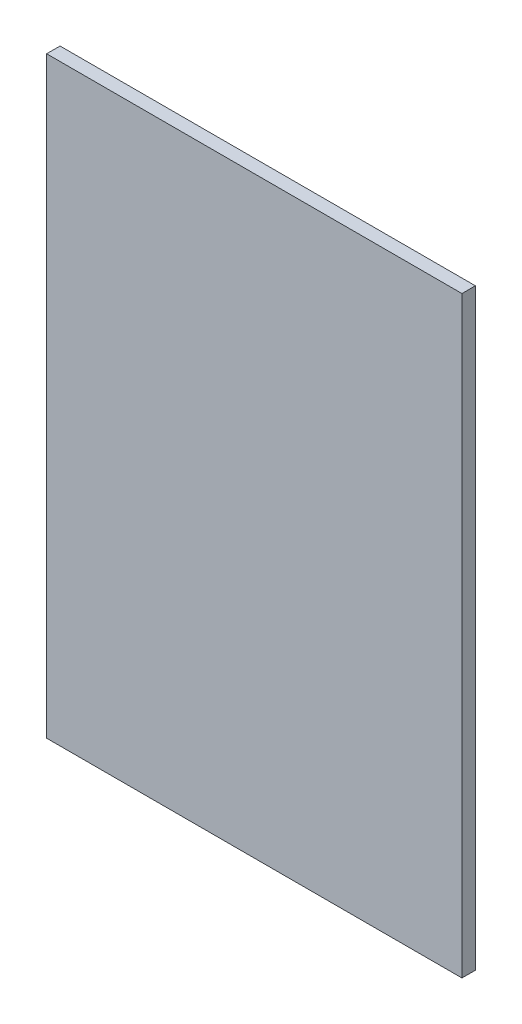
ISO-10303-21;
HEADER;
FILE_DESCRIPTION(('STEP AP214'),'2;1');
FILE_NAME('part.step','',(''),(''),'','','');
FILE_SCHEMA(('AUTOMOTIVE_DESIGN { 1 0 10303 214 1 1 1 1 }'));
ENDSEC;
DATA;
#1=APPLICATION_CONTEXT('core data for automotive mechanical design processes');
#2=APPLICATION_PROTOCOL_DEFINITION('international standard','automotive_design',2000,#1);
#3=PRODUCT_CONTEXT('',#1,'mechanical');
#4=PRODUCT('Part','Part','',(#3));
#5=PRODUCT_RELATED_PRODUCT_CATEGORY('part','',(#4));
#6=PRODUCT_DEFINITION_FORMATION('','',#4);
#7=PRODUCT_DEFINITION_CONTEXT('part definition',#1,'design');
#8=PRODUCT_DEFINITION('design','',#6,#7);
#9=PRODUCT_DEFINITION_SHAPE('','',#8);
#10=(LENGTH_UNIT() NAMED_UNIT(*) SI_UNIT(.MILLI.,.METRE.));
#11=(NAMED_UNIT(*) PLANE_ANGLE_UNIT() SI_UNIT($,.RADIAN.));
#12=(NAMED_UNIT(*) SI_UNIT($,.STERADIAN.) SOLID_ANGLE_UNIT());
#13=UNCERTAINTY_MEASURE_WITH_UNIT(LENGTH_MEASURE(1.E-05),#10,'distance_accuracy_value','');
#14=(GEOMETRIC_REPRESENTATION_CONTEXT(3) GLOBAL_UNCERTAINTY_ASSIGNED_CONTEXT((#13)) GLOBAL_UNIT_ASSIGNED_CONTEXT((#10,
#11,#12)) REPRESENTATION_CONTEXT('',''));
#15=CARTESIAN_POINT('',(0.,0.,0.));
#16=DIRECTION('',(0.,0.,1.));
#17=DIRECTION('',(1.,0.,0.));
#18=AXIS2_PLACEMENT_3D('',#15,#16,#17);
#19=CARTESIAN_POINT('',(96.5770034790039,93.4720001220703,0.));
#20=DIRECTION('',(1.,0.,0.));
#21=DIRECTION('',(0.,-1.,0.));
#22=AXIS2_PLACEMENT_3D('',#19,#20,#21);
#23=PLANE('',#22);
#24=DIRECTION('',(0.,-1.,0.));
#25=VECTOR('',#24,1.);
#26=CARTESIAN_POINT('',(96.5770034790039,93.4720001220703,0.03556));
#27=LINE('',#26,#25);
#28=CARTESIAN_POINT('',(96.5770034790039,93.4720001220703,0.03556));
#29=VERTEX_POINT('',#28);
#30=CARTESIAN_POINT('',(96.5770034790039,91.9020004272461,0.03556));
#31=VERTEX_POINT('',#30);
#32=EDGE_CURVE('E11',#29,#31,#27,.T.);
#33=ORIENTED_EDGE('',*,*,#32,.F.);
#34=DIRECTION('',(0.,0.,1.));
#35=VECTOR('',#34,1.);
#36=CARTESIAN_POINT('',(96.5770034790039,93.4720001220703,0.));
#37=LINE('',#36,#35);
#38=CARTESIAN_POINT('',(96.5770034790039,93.4720001220703,0.));
#39=VERTEX_POINT('',#38);
#40=EDGE_CURVE('E24',#39,#29,#37,.T.);
#41=ORIENTED_EDGE('',*,*,#40,.F.);
#42=DIRECTION('',(0.,-1.,0.));
#43=VECTOR('',#42,1.);
#44=CARTESIAN_POINT('',(96.5770034790039,93.4720001220703,0.));
#45=LINE('',#44,#43);
#46=CARTESIAN_POINT('',(96.5770034790039,91.9020004272461,0.));
#47=VERTEX_POINT('',#46);
#48=EDGE_CURVE('E75',#39,#47,#45,.T.);
#49=ORIENTED_EDGE('',*,*,#48,.T.);
#50=DIRECTION('',(0.,0.,1.));
#51=VECTOR('',#50,1.);
#52=CARTESIAN_POINT('',(96.5770034790039,91.9020004272461,0.));
#53=LINE('',#52,#51);
#54=EDGE_CURVE('E37',#47,#31,#53,.T.);
#55=ORIENTED_EDGE('',*,*,#54,.T.);
#56=EDGE_LOOP('',(#33,#41,#49,#55));
#57=FACE_BOUND('',#56,.T.);
#58=ADVANCED_FACE('F17',(#57),#23,.F.);
#59=CARTESIAN_POINT('',(96.5770034790039,91.9020004272461,0.));
#60=DIRECTION('',(0.,1.,0.));
#61=DIRECTION('',(1.,0.,0.));
#62=AXIS2_PLACEMENT_3D('',#59,#60,#61);
#63=PLANE('',#62);
#64=DIRECTION('',(1.,0.,0.));
#65=VECTOR('',#64,1.);
#66=CARTESIAN_POINT('',(96.5770034790039,91.9020004272461,0.03556));
#67=LINE('',#66,#65);
#68=CARTESIAN_POINT('',(97.677001953125,91.9020004272461,0.03556));
#69=VERTEX_POINT('',#68);
#70=EDGE_CURVE('E83',#31,#69,#67,.T.);
#71=ORIENTED_EDGE('',*,*,#70,.F.);
#72=ORIENTED_EDGE('',*,*,#54,.F.);
#73=DIRECTION('',(1.,0.,0.));
#74=VECTOR('',#73,1.);
#75=CARTESIAN_POINT('',(96.5770034790039,91.9020004272461,0.));
#76=LINE('',#75,#74);
#77=CARTESIAN_POINT('',(97.677001953125,91.9020004272461,0.));
#78=VERTEX_POINT('',#77);
#79=EDGE_CURVE('E81',#47,#78,#76,.T.);
#80=ORIENTED_EDGE('',*,*,#79,.T.);
#81=DIRECTION('',(0.,0.,1.));
#82=VECTOR('',#81,1.);
#83=CARTESIAN_POINT('',(97.677001953125,91.9020004272461,0.));
#84=LINE('',#83,#82);
#85=EDGE_CURVE('E67',#78,#69,#84,.T.);
#86=ORIENTED_EDGE('',*,*,#85,.T.);
#87=EDGE_LOOP('',(#71,#72,#80,#86));
#88=FACE_BOUND('',#87,.T.);
#89=ADVANCED_FACE('F89',(#88),#63,.F.);
#90=CARTESIAN_POINT('',(97.677001953125,91.9020004272461,0.));
#91=DIRECTION('',(-1.,0.,0.));
#92=DIRECTION('',(0.,1.,0.));
#93=AXIS2_PLACEMENT_3D('',#90,#91,#92);
#94=PLANE('',#93);
#95=DIRECTION('',(0.,1.,0.));
#96=VECTOR('',#95,1.);
#97=CARTESIAN_POINT('',(97.677001953125,91.9020004272461,0.03556));
#98=LINE('',#97,#96);
#99=CARTESIAN_POINT('',(97.677001953125,93.4720001220703,0.03556));
#100=VERTEX_POINT('',#99);
#101=EDGE_CURVE('E71',#69,#100,#98,.T.);
#102=ORIENTED_EDGE('',*,*,#101,.F.);
#103=ORIENTED_EDGE('',*,*,#85,.F.);
#104=DIRECTION('',(0.,1.,0.));
#105=VECTOR('',#104,1.);
#106=CARTESIAN_POINT('',(97.677001953125,91.9020004272461,0.));
#107=LINE('',#106,#105);
#108=CARTESIAN_POINT('',(97.677001953125,93.4720001220703,0.));
#109=VERTEX_POINT('',#108);
#110=EDGE_CURVE('E63',#78,#109,#107,.T.);
#111=ORIENTED_EDGE('',*,*,#110,.T.);
#112=DIRECTION('',(0.,0.,1.));
#113=VECTOR('',#112,1.);
#114=CARTESIAN_POINT('',(97.677001953125,93.4720001220703,0.));
#115=LINE('',#114,#113);
#116=EDGE_CURVE('E53',#109,#100,#115,.T.);
#117=ORIENTED_EDGE('',*,*,#116,.T.);
#118=EDGE_LOOP('',(#102,#103,#111,#117));
#119=FACE_BOUND('',#118,.T.);
#120=ADVANCED_FACE('F66',(#119),#94,.F.);
#121=CARTESIAN_POINT('',(97.677001953125,93.4720001220703,0.));
#122=DIRECTION('',(0.,-1.,0.));
#123=DIRECTION('',(-1.,0.,0.));
#124=AXIS2_PLACEMENT_3D('',#121,#122,#123);
#125=PLANE('',#124);
#126=DIRECTION('',(-1.,0.,0.));
#127=VECTOR('',#126,1.);
#128=CARTESIAN_POINT('',(97.677001953125,93.4720001220703,0.03556));
#129=LINE('',#128,#127);
#130=EDGE_CURVE('E59',#100,#29,#129,.T.);
#131=ORIENTED_EDGE('',*,*,#130,.F.);
#132=ORIENTED_EDGE('',*,*,#116,.F.);
#133=DIRECTION('',(-1.,0.,0.));
#134=VECTOR('',#133,1.);
#135=CARTESIAN_POINT('',(97.677001953125,93.4720001220703,0.));
#136=LINE('',#135,#134);
#137=EDGE_CURVE('E57',#109,#39,#136,.T.);
#138=ORIENTED_EDGE('',*,*,#137,.T.);
#139=ORIENTED_EDGE('',*,*,#40,.T.);
#140=EDGE_LOOP('',(#131,#132,#138,#139));
#141=FACE_BOUND('',#140,.T.);
#142=ADVANCED_FACE('F55',(#141),#125,.F.);
#143=CARTESIAN_POINT('',(96.5770034790039,93.4720001220703,0.));
#144=DIRECTION('',(0.,0.,-1.));
#145=DIRECTION('',(-1.,0.,0.));
#146=AXIS2_PLACEMENT_3D('',#143,#144,#145);
#147=PLANE('',#146);
#148=ORIENTED_EDGE('',*,*,#137,.F.);
#149=ORIENTED_EDGE('',*,*,#110,.F.);
#150=ORIENTED_EDGE('',*,*,#79,.F.);
#151=ORIENTED_EDGE('',*,*,#48,.F.);
#152=EDGE_LOOP('',(#148,#149,#150,#151));
#153=FACE_BOUND('',#152,.T.);
#154=ADVANCED_FACE('F74',(#153),#147,.T.);
#155=CARTESIAN_POINT('',(96.5770034790039,93.4720001220703,0.03556));
#156=DIRECTION('',(0.,0.,-1.));
#157=DIRECTION('',(-1.,0.,0.));
#158=AXIS2_PLACEMENT_3D('',#155,#156,#157);
#159=PLANE('',#158);
#160=ORIENTED_EDGE('',*,*,#32,.T.);
#161=ORIENTED_EDGE('',*,*,#70,.T.);
#162=ORIENTED_EDGE('',*,*,#101,.T.);
#163=ORIENTED_EDGE('',*,*,#130,.T.);
#164=EDGE_LOOP('',(#160,#161,#162,#163));
#165=FACE_BOUND('',#164,.T.);
#166=ADVANCED_FACE('F91',(#165),#159,.F.);
#167=CLOSED_SHELL('',(#58,#89,#120,#142,#154,#166));
#168=MANIFOLD_SOLID_BREP('B1',#167);
#169=ADVANCED_BREP_SHAPE_REPRESENTATION('',(#18,#168),#14);
#170=SHAPE_DEFINITION_REPRESENTATION(#9,#169);
ENDSEC;
END-ISO-10303-21;
